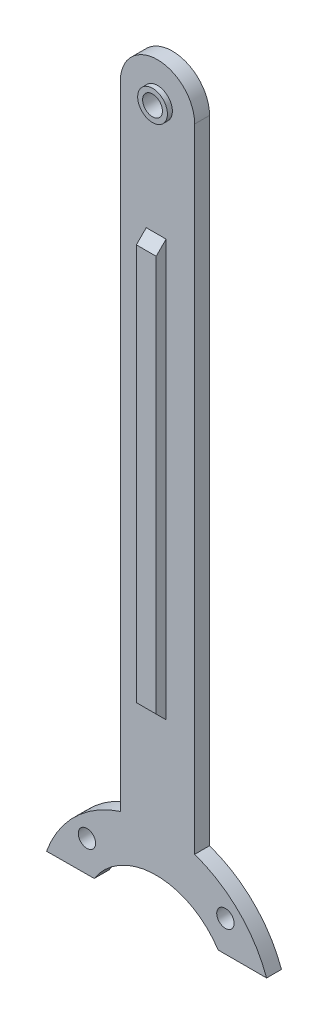
ISO-10303-21;
HEADER;
FILE_DESCRIPTION(('STEP AP214'),'2;1');
FILE_NAME('part.step','',(''),(''),'','','');
FILE_SCHEMA(('AUTOMOTIVE_DESIGN { 1 0 10303 214 1 1 1 1 }'));
ENDSEC;
DATA;
#1=APPLICATION_CONTEXT('core data for automotive mechanical design processes');
#2=APPLICATION_PROTOCOL_DEFINITION('international standard','automotive_design',2000,#1);
#3=PRODUCT_CONTEXT('',#1,'mechanical');
#4=PRODUCT('Part','Part','',(#3));
#5=PRODUCT_RELATED_PRODUCT_CATEGORY('part','',(#4));
#6=PRODUCT_DEFINITION_FORMATION('','',#4);
#7=PRODUCT_DEFINITION_CONTEXT('part definition',#1,'design');
#8=PRODUCT_DEFINITION('design','',#6,#7);
#9=PRODUCT_DEFINITION_SHAPE('','',#8);
#10=(LENGTH_UNIT() NAMED_UNIT(*) SI_UNIT(.MILLI.,.METRE.));
#11=(NAMED_UNIT(*) PLANE_ANGLE_UNIT() SI_UNIT($,.RADIAN.));
#12=(NAMED_UNIT(*) SI_UNIT($,.STERADIAN.) SOLID_ANGLE_UNIT());
#13=UNCERTAINTY_MEASURE_WITH_UNIT(LENGTH_MEASURE(1.E-05),#10,'distance_accuracy_value','');
#14=(GEOMETRIC_REPRESENTATION_CONTEXT(3) GLOBAL_UNCERTAINTY_ASSIGNED_CONTEXT((#13)) GLOBAL_UNIT_ASSIGNED_CONTEXT((#10,
#11,#12)) REPRESENTATION_CONTEXT('',''));
#15=CARTESIAN_POINT('',(0.,0.,0.));
#16=DIRECTION('',(0.,0.,1.));
#17=DIRECTION('',(1.,0.,0.));
#18=AXIS2_PLACEMENT_3D('',#15,#16,#17);
#19=CARTESIAN_POINT('',(-29.0000000968576,29.0000015694326,3.));
#20=DIRECTION('',(0.,0.,-1.));
#21=DIRECTION('',(-1.,0.,0.));
#22=AXIS2_PLACEMENT_3D('',#19,#20,#21);
#23=PLANE('',#22);
#24=CARTESIAN_POINT('',(-28.7319590709669,178.999762082603,3.));
#25=DIRECTION('',(0.,0.,-1.));
#26=DIRECTION('',(-1.,0.,0.));
#27=AXIS2_PLACEMENT_3D('',#24,#25,#26);
#28=CIRCLE('',#27,2.99999999999999);
#29=CARTESIAN_POINT('',(-31.7319590709669,178.999762082603,3.));
#30=VERTEX_POINT('',#29);
#31=EDGE_CURVE('E143',#30,#30,#28,.F.);
#32=ORIENTED_EDGE('',*,*,#31,.F.);
#33=EDGE_LOOP('',(#32));
#34=FACE_BOUND('',#33,.T.);
#35=CARTESIAN_POINT('',(-29.0000000968576,29.0000015694326,3.));
#36=DIRECTION('',(0.,0.,-1.));
#37=DIRECTION('',(-1.,0.,0.));
#38=AXIS2_PLACEMENT_3D('',#35,#36,#37);
#39=CIRCLE('',#38,14.8499991396063);
#40=CARTESIAN_POINT('',(-41.4972007274628,37.0213761925697,3.));
#41=VERTEX_POINT('',#40);
#42=CARTESIAN_POINT('',(-16.5027994662523,37.0213761925697,3.));
#43=VERTEX_POINT('',#42);
#44=EDGE_CURVE('E129',#41,#43,#39,.T.);
#45=ORIENTED_EDGE('',*,*,#44,.T.);
#46=DIRECTION('',(1.,0.,0.));
#47=VECTOR('',#46,1.);
#48=CARTESIAN_POINT('',(-16.5027994662523,37.0213761925697,3.));
#49=LINE('',#48,#47);
#50=CARTESIAN_POINT('',(-6.71536289155483,37.0213761925697,3.));
#51=VERTEX_POINT('',#50);
#52=EDGE_CURVE('E118',#43,#51,#49,.T.);
#53=ORIENTED_EDGE('',*,*,#52,.T.);
#54=CARTESIAN_POINT('',(-29.0000000968576,29.0000015694326,3.));
#55=DIRECTION('',(0.,0.,1.));
#56=DIRECTION('',(1.,0.,0.));
#57=AXIS2_PLACEMENT_3D('',#54,#55,#56);
#58=CIRCLE('',#57,23.6843303940954);
#59=CARTESIAN_POINT('',(-21.2319590709669,51.3742064678586,3.));
#60=VERTEX_POINT('',#59);
#61=EDGE_CURVE('E128',#51,#60,#58,.T.);
#62=ORIENTED_EDGE('',*,*,#61,.T.);
#63=DIRECTION('',(0.,1.,0.));
#64=VECTOR('',#63,1.);
#65=CARTESIAN_POINT('',(-21.2319590709669,178.999762082603,3.));
#66=LINE('',#65,#64);
#67=CARTESIAN_POINT('',(-21.2319590709669,178.999762082603,3.));
#68=VERTEX_POINT('',#67);
#69=EDGE_CURVE('E214',#60,#68,#66,.T.);
#70=ORIENTED_EDGE('',*,*,#69,.T.);
#71=CARTESIAN_POINT('',(-28.7319590709669,178.999762082603,3.));
#72=DIRECTION('',(0.,0.,1.));
#73=DIRECTION('',(1.,0.,0.));
#74=AXIS2_PLACEMENT_3D('',#71,#72,#73);
#75=CIRCLE('',#74,7.50000000000001);
#76=CARTESIAN_POINT('',(-36.2319590709669,178.999762082603,3.));
#77=VERTEX_POINT('',#76);
#78=EDGE_CURVE('E216',#68,#77,#75,.T.);
#79=ORIENTED_EDGE('',*,*,#78,.T.);
#80=DIRECTION('',(0.,-1.,0.));
#81=VECTOR('',#80,1.);
#82=CARTESIAN_POINT('',(-36.2319590709669,51.3739538020425,3.));
#83=LINE('',#82,#81);
#84=CARTESIAN_POINT('',(-36.2319590709669,51.3739538020425,3.));
#85=VERTEX_POINT('',#84);
#86=EDGE_CURVE('E218',#77,#85,#83,.T.);
#87=ORIENTED_EDGE('',*,*,#86,.T.);
#88=CARTESIAN_POINT('',(-29.0000000968576,29.0000015694326,3.));
#89=DIRECTION('',(0.,0.,1.));
#90=DIRECTION('',(1.,0.,0.));
#91=AXIS2_PLACEMENT_3D('',#88,#89,#90);
#92=CIRCLE('',#91,23.5137187426896);
#93=CARTESIAN_POINT('',(-51.1241088556617,36.9635925144095,3.));
#94=VERTEX_POINT('',#93);
#95=EDGE_CURVE('E220',#85,#94,#92,.T.);
#96=ORIENTED_EDGE('',*,*,#95,.T.);
#97=DIRECTION('',(0.999981986629532,0.00600220096753658,0.));
#98=VECTOR('',#97,1.);
#99=CARTESIAN_POINT('',(-51.1241088556617,36.9635925144095,3.));
#100=LINE('',#99,#98);
#101=EDGE_CURVE('E134',#94,#41,#100,.T.);
#102=ORIENTED_EDGE('',*,*,#101,.T.);
#103=EDGE_LOOP('',(#45,#53,#62,#70,#79,#87,#96,#102));
#104=FACE_BOUND('',#103,.T.);
#105=CARTESIAN_POINT('',(-42.9680608212948,43.2889966521514,3.));
#106=DIRECTION('',(0.,0.,1.));
#107=DIRECTION('',(1.,0.,0.));
#108=AXIS2_PLACEMENT_3D('',#105,#106,#107);
#109=CIRCLE('',#108,1.75000070478217);
#110=CARTESIAN_POINT('',(-41.2180601165126,43.2889966521514,3.));
#111=VERTEX_POINT('',#110);
#112=EDGE_CURVE('E208',#111,#111,#109,.T.);
#113=ORIENTED_EDGE('',*,*,#112,.F.);
#114=EDGE_LOOP('',(#113));
#115=FACE_BOUND('',#114,.T.);
#116=CARTESIAN_POINT('',(-15.030000194473,43.2889966521514,3.));
#117=DIRECTION('',(0.,0.,1.));
#118=DIRECTION('',(1.,0.,0.));
#119=AXIS2_PLACEMENT_3D('',#116,#117,#118);
#120=CIRCLE('',#119,1.75000070478217);
#121=CARTESIAN_POINT('',(-13.2799994896908,43.2889966521514,3.));
#122=VERTEX_POINT('',#121);
#123=EDGE_CURVE('E202',#122,#122,#120,.T.);
#124=ORIENTED_EDGE('',*,*,#123,.F.);
#125=EDGE_LOOP('',(#124));
#126=FACE_BOUND('',#125,.T.);
#127=DIRECTION('',(0.,1.,0.));
#128=VECTOR('',#127,1.);
#129=CARTESIAN_POINT('',(-27.0000000968576,64.0021571401982,3.));
#130=LINE('',#129,#128);
#131=CARTESIAN_POINT('',(-27.0000000968576,72.0021571401983,3.));
#132=VERTEX_POINT('',#131);
#133=CARTESIAN_POINT('',(-27.0000000968576,156.002157140198,3.));
#134=VERTEX_POINT('',#133);
#135=EDGE_CURVE('E168',#132,#134,#130,.T.);
#136=ORIENTED_EDGE('',*,*,#135,.F.);
#137=DIRECTION('',(-1.,0.,0.));
#138=VECTOR('',#137,1.);
#139=CARTESIAN_POINT('',(-29.0000000968576,72.0021571401983,3.));
#140=LINE('',#139,#138);
#141=CARTESIAN_POINT('',(-31.0000000968576,72.0021571401983,3.));
#142=VERTEX_POINT('',#141);
#143=EDGE_CURVE('E11',#132,#142,#140,.T.);
#144=ORIENTED_EDGE('',*,*,#143,.T.);
#145=DIRECTION('',(0.,1.,0.));
#146=VECTOR('',#145,1.);
#147=CARTESIAN_POINT('',(-31.0000000968576,64.0021571401982,3.));
#148=LINE('',#147,#146);
#149=CARTESIAN_POINT('',(-31.0000000968575,156.002157140198,3.));
#150=VERTEX_POINT('',#149);
#151=EDGE_CURVE('E170',#142,#150,#148,.T.);
#152=ORIENTED_EDGE('',*,*,#151,.T.);
#153=DIRECTION('',(1.,0.,0.));
#154=VECTOR('',#153,1.);
#155=CARTESIAN_POINT('',(-29.0000000968576,156.002157140198,3.));
#156=LINE('',#155,#154);
#157=EDGE_CURVE('E43',#150,#134,#156,.T.);
#158=ORIENTED_EDGE('',*,*,#157,.T.);
#159=EDGE_LOOP('',(#136,#144,#152,#158));
#160=FACE_BOUND('',#159,.T.);
#161=ADVANCED_FACE('F34',(#34,#104,#115,#126,#160),#23,.F.);
#162=CARTESIAN_POINT('',(-29.0000000968576,29.0000015694326,0.));
#163=DIRECTION('',(0.,0.,-1.));
#164=DIRECTION('',(-1.,0.,0.));
#165=AXIS2_PLACEMENT_3D('',#162,#163,#164);
#166=PLANE('',#165);
#167=CARTESIAN_POINT('',(-15.030000194473,43.2889966521514,0.));
#168=DIRECTION('',(0.,0.,1.));
#169=DIRECTION('',(1.,0.,0.));
#170=AXIS2_PLACEMENT_3D('',#167,#168,#169);
#171=CIRCLE('',#170,1.75000070478217);
#172=CARTESIAN_POINT('',(-13.2799994896908,43.2889966521514,0.));
#173=VERTEX_POINT('',#172);
#174=EDGE_CURVE('E201',#173,#173,#171,.T.);
#175=ORIENTED_EDGE('',*,*,#174,.T.);
#176=EDGE_LOOP('',(#175));
#177=FACE_BOUND('',#176,.T.);
#178=CARTESIAN_POINT('',(-29.0000000968576,29.0000015694326,0.));
#179=DIRECTION('',(0.,0.,-1.));
#180=DIRECTION('',(-1.,0.,0.));
#181=AXIS2_PLACEMENT_3D('',#178,#179,#180);
#182=CIRCLE('',#181,14.8499991396063);
#183=CARTESIAN_POINT('',(-41.4972007274628,37.0213761925697,0.));
#184=VERTEX_POINT('',#183);
#185=CARTESIAN_POINT('',(-16.5027994662523,37.0213761925697,0.));
#186=VERTEX_POINT('',#185);
#187=EDGE_CURVE('E142',#184,#186,#182,.T.);
#188=ORIENTED_EDGE('',*,*,#187,.F.);
#189=DIRECTION('',(0.999981986629532,0.00600220096753658,0.));
#190=VECTOR('',#189,1.);
#191=CARTESIAN_POINT('',(-51.1241088556617,36.9635925144095,0.));
#192=LINE('',#191,#190);
#193=CARTESIAN_POINT('',(-51.1241088556617,36.9635925144095,0.));
#194=VERTEX_POINT('',#193);
#195=EDGE_CURVE('E138',#194,#184,#192,.T.);
#196=ORIENTED_EDGE('',*,*,#195,.F.);
#197=CARTESIAN_POINT('',(-29.0000000968576,29.0000015694326,0.));
#198=DIRECTION('',(0.,0.,1.));
#199=DIRECTION('',(1.,0.,0.));
#200=AXIS2_PLACEMENT_3D('',#197,#198,#199);
#201=CIRCLE('',#200,23.5137187426896);
#202=CARTESIAN_POINT('',(-36.2319590709669,51.3739538020425,0.));
#203=VERTEX_POINT('',#202);
#204=EDGE_CURVE('E235',#203,#194,#201,.T.);
#205=ORIENTED_EDGE('',*,*,#204,.F.);
#206=DIRECTION('',(0.,-1.,0.));
#207=VECTOR('',#206,1.);
#208=CARTESIAN_POINT('',(-36.2319590709669,51.3739538020425,0.));
#209=LINE('',#208,#207);
#210=CARTESIAN_POINT('',(-36.2319590709669,178.999762082603,0.));
#211=VERTEX_POINT('',#210);
#212=EDGE_CURVE('E233',#211,#203,#209,.T.);
#213=ORIENTED_EDGE('',*,*,#212,.F.);
#214=CARTESIAN_POINT('',(-28.7319590709669,178.999762082603,0.));
#215=DIRECTION('',(0.,0.,1.));
#216=DIRECTION('',(1.,0.,0.));
#217=AXIS2_PLACEMENT_3D('',#214,#215,#216);
#218=CIRCLE('',#217,7.50000000000001);
#219=CARTESIAN_POINT('',(-21.2319590709669,178.999762082603,0.));
#220=VERTEX_POINT('',#219);
#221=EDGE_CURVE('E231',#220,#211,#218,.T.);
#222=ORIENTED_EDGE('',*,*,#221,.F.);
#223=DIRECTION('',(0.,1.,0.));
#224=VECTOR('',#223,1.);
#225=CARTESIAN_POINT('',(-21.2319590709669,178.999762082603,0.));
#226=LINE('',#225,#224);
#227=CARTESIAN_POINT('',(-21.2319590709669,51.3742064678586,0.));
#228=VERTEX_POINT('',#227);
#229=EDGE_CURVE('E229',#228,#220,#226,.T.);
#230=ORIENTED_EDGE('',*,*,#229,.F.);
#231=CARTESIAN_POINT('',(-29.0000000968576,29.0000015694326,0.));
#232=DIRECTION('',(0.,0.,1.));
#233=DIRECTION('',(1.,0.,0.));
#234=AXIS2_PLACEMENT_3D('',#231,#232,#233);
#235=CIRCLE('',#234,23.6843303940954);
#236=CARTESIAN_POINT('',(-6.71536289155483,37.0213761925697,0.));
#237=VERTEX_POINT('',#236);
#238=EDGE_CURVE('E227',#237,#228,#235,.T.);
#239=ORIENTED_EDGE('',*,*,#238,.F.);
#240=DIRECTION('',(1.,0.,0.));
#241=VECTOR('',#240,1.);
#242=CARTESIAN_POINT('',(-16.5027994662523,37.0213761925697,0.));
#243=LINE('',#242,#241);
#244=EDGE_CURVE('E225',#186,#237,#243,.T.);
#245=ORIENTED_EDGE('',*,*,#244,.F.);
#246=EDGE_LOOP('',(#188,#196,#205,#213,#222,#230,#239,#245));
#247=FACE_BOUND('',#246,.T.);
#248=CARTESIAN_POINT('',(-42.9680608212948,43.2889966521514,0.));
#249=DIRECTION('',(0.,0.,1.));
#250=DIRECTION('',(1.,0.,0.));
#251=AXIS2_PLACEMENT_3D('',#248,#249,#250);
#252=CIRCLE('',#251,1.75000070478217);
#253=CARTESIAN_POINT('',(-41.2180601165126,43.2889966521514,0.));
#254=VERTEX_POINT('',#253);
#255=EDGE_CURVE('E205',#254,#254,#252,.T.);
#256=ORIENTED_EDGE('',*,*,#255,.T.);
#257=EDGE_LOOP('',(#256));
#258=FACE_BOUND('',#257,.T.);
#259=CARTESIAN_POINT('',(-28.7319590709669,178.999762082603,0.));
#260=DIRECTION('',(0.,0.,1.));
#261=DIRECTION('',(1.,0.,0.));
#262=AXIS2_PLACEMENT_3D('',#259,#260,#261);
#263=CIRCLE('',#262,2.00000000365453);
#264=CARTESIAN_POINT('',(-26.7319590673123,178.999762082603,0.));
#265=VERTEX_POINT('',#264);
#266=EDGE_CURVE('E198',#265,#265,#263,.T.);
#267=ORIENTED_EDGE('',*,*,#266,.T.);
#268=EDGE_LOOP('',(#267));
#269=FACE_BOUND('',#268,.T.);
#270=ADVANCED_FACE('F261',(#177,#247,#258,#269),#166,.T.);
#271=CARTESIAN_POINT('',(-29.0000000968576,29.0000015694326,3.));
#272=DIRECTION('',(0.,0.,-1.));
#273=DIRECTION('',(-1.,0.,0.));
#274=AXIS2_PLACEMENT_3D('',#271,#272,#273);
#275=CYLINDRICAL_SURFACE('',#274,14.8499991396063);
#276=ORIENTED_EDGE('',*,*,#187,.T.);
#277=DIRECTION('',(0.,0.,-1.));
#278=VECTOR('',#277,1.);
#279=CARTESIAN_POINT('',(-16.5027994662523,37.0213761925697,3.));
#280=LINE('',#279,#278);
#281=EDGE_CURVE('E122',#43,#186,#280,.T.);
#282=ORIENTED_EDGE('',*,*,#281,.F.);
#283=ORIENTED_EDGE('',*,*,#44,.F.);
#284=DIRECTION('',(0.,0.,-1.));
#285=VECTOR('',#284,1.);
#286=CARTESIAN_POINT('',(-41.4972007274628,37.0213761925697,3.));
#287=LINE('',#286,#285);
#288=EDGE_CURVE('E223',#41,#184,#287,.T.);
#289=ORIENTED_EDGE('',*,*,#288,.T.);
#290=EDGE_LOOP('',(#276,#282,#283,#289));
#291=FACE_BOUND('',#290,.T.);
#292=ADVANCED_FACE('F140',(#291),#275,.F.);
#293=CARTESIAN_POINT('',(-16.5027994662523,37.0213761925697,3.));
#294=DIRECTION('',(0.,1.,0.));
#295=DIRECTION('',(0.,0.,1.));
#296=AXIS2_PLACEMENT_3D('',#293,#294,#295);
#297=PLANE('',#296);
#298=ORIENTED_EDGE('',*,*,#244,.T.);
#299=DIRECTION('',(0.,0.,-1.));
#300=VECTOR('',#299,1.);
#301=CARTESIAN_POINT('',(-6.71536289155483,37.0213761925697,3.));
#302=LINE('',#301,#300);
#303=EDGE_CURVE('E125',#51,#237,#302,.T.);
#304=ORIENTED_EDGE('',*,*,#303,.F.);
#305=ORIENTED_EDGE('',*,*,#52,.F.);
#306=ORIENTED_EDGE('',*,*,#281,.T.);
#307=EDGE_LOOP('',(#298,#304,#305,#306));
#308=FACE_BOUND('',#307,.T.);
#309=ADVANCED_FACE('F120',(#308),#297,.F.);
#310=CARTESIAN_POINT('',(-29.0000000968576,29.0000015694326,3.));
#311=DIRECTION('',(0.,0.,-1.));
#312=DIRECTION('',(-1.,0.,0.));
#313=AXIS2_PLACEMENT_3D('',#310,#311,#312);
#314=CYLINDRICAL_SURFACE('',#313,23.6843303940954);
#315=ORIENTED_EDGE('',*,*,#238,.T.);
#316=DIRECTION('',(0.,0.,-1.));
#317=VECTOR('',#316,1.);
#318=CARTESIAN_POINT('',(-21.2319590709669,51.3742064678586,3.));
#319=LINE('',#318,#317);
#320=EDGE_CURVE('E148',#60,#228,#319,.T.);
#321=ORIENTED_EDGE('',*,*,#320,.F.);
#322=ORIENTED_EDGE('',*,*,#61,.F.);
#323=ORIENTED_EDGE('',*,*,#303,.T.);
#324=EDGE_LOOP('',(#315,#321,#322,#323));
#325=FACE_BOUND('',#324,.T.);
#326=ADVANCED_FACE('F275',(#325),#314,.T.);
#327=CARTESIAN_POINT('',(-21.2319590709669,178.999762082603,3.));
#328=DIRECTION('',(-1.,0.,0.));
#329=DIRECTION('',(0.,-1.,0.));
#330=AXIS2_PLACEMENT_3D('',#327,#328,#329);
#331=PLANE('',#330);
#332=ORIENTED_EDGE('',*,*,#229,.T.);
#333=DIRECTION('',(0.,0.,-1.));
#334=VECTOR('',#333,1.);
#335=CARTESIAN_POINT('',(-21.2319590709669,178.999762082603,3.));
#336=LINE('',#335,#334);
#337=EDGE_CURVE('E248',#68,#220,#336,.T.);
#338=ORIENTED_EDGE('',*,*,#337,.F.);
#339=ORIENTED_EDGE('',*,*,#69,.F.);
#340=ORIENTED_EDGE('',*,*,#320,.T.);
#341=EDGE_LOOP('',(#332,#338,#339,#340));
#342=FACE_BOUND('',#341,.T.);
#343=ADVANCED_FACE('F255',(#342),#331,.F.);
#344=CARTESIAN_POINT('',(-28.7319590709669,178.999762082603,3.));
#345=DIRECTION('',(0.,0.,-1.));
#346=DIRECTION('',(-1.,0.,0.));
#347=AXIS2_PLACEMENT_3D('',#344,#345,#346);
#348=CYLINDRICAL_SURFACE('',#347,7.50000000000001);
#349=ORIENTED_EDGE('',*,*,#221,.T.);
#350=DIRECTION('',(0.,0.,-1.));
#351=VECTOR('',#350,1.);
#352=CARTESIAN_POINT('',(-36.2319590709669,178.999762082603,3.));
#353=LINE('',#352,#351);
#354=EDGE_CURVE('E245',#77,#211,#353,.T.);
#355=ORIENTED_EDGE('',*,*,#354,.F.);
#356=ORIENTED_EDGE('',*,*,#78,.F.);
#357=ORIENTED_EDGE('',*,*,#337,.T.);
#358=EDGE_LOOP('',(#349,#355,#356,#357));
#359=FACE_BOUND('',#358,.T.);
#360=ADVANCED_FACE('F267',(#359),#348,.T.);
#361=CARTESIAN_POINT('',(-36.2319590709669,51.3739538020425,3.));
#362=DIRECTION('',(1.,0.,0.));
#363=DIRECTION('',(0.,1.,0.));
#364=AXIS2_PLACEMENT_3D('',#361,#362,#363);
#365=PLANE('',#364);
#366=ORIENTED_EDGE('',*,*,#212,.T.);
#367=DIRECTION('',(0.,0.,-1.));
#368=VECTOR('',#367,1.);
#369=CARTESIAN_POINT('',(-36.2319590709669,51.3739538020425,3.));
#370=LINE('',#369,#368);
#371=EDGE_CURVE('E242',#85,#203,#370,.T.);
#372=ORIENTED_EDGE('',*,*,#371,.F.);
#373=ORIENTED_EDGE('',*,*,#86,.F.);
#374=ORIENTED_EDGE('',*,*,#354,.T.);
#375=EDGE_LOOP('',(#366,#372,#373,#374));
#376=FACE_BOUND('',#375,.T.);
#377=ADVANCED_FACE('F271',(#376),#365,.F.);
#378=CARTESIAN_POINT('',(-29.0000000968576,29.0000015694326,3.));
#379=DIRECTION('',(0.,0.,-1.));
#380=DIRECTION('',(-1.,0.,0.));
#381=AXIS2_PLACEMENT_3D('',#378,#379,#380);
#382=CYLINDRICAL_SURFACE('',#381,23.5137187426896);
#383=ORIENTED_EDGE('',*,*,#204,.T.);
#384=DIRECTION('',(0.,0.,-1.));
#385=VECTOR('',#384,1.);
#386=CARTESIAN_POINT('',(-51.1241088556617,36.9635925144095,3.));
#387=LINE('',#386,#385);
#388=EDGE_CURVE('E239',#94,#194,#387,.T.);
#389=ORIENTED_EDGE('',*,*,#388,.F.);
#390=ORIENTED_EDGE('',*,*,#95,.F.);
#391=ORIENTED_EDGE('',*,*,#371,.T.);
#392=EDGE_LOOP('',(#383,#389,#390,#391));
#393=FACE_BOUND('',#392,.T.);
#394=ADVANCED_FACE('F300',(#393),#382,.T.);
#395=CARTESIAN_POINT('',(-51.1241088556617,36.9635925144095,3.));
#396=DIRECTION('',(-0.00600220096753658,0.999981986629532,0.));
#397=DIRECTION('',(-0.999981986629532,-0.00600220096753658,0.));
#398=AXIS2_PLACEMENT_3D('',#395,#396,#397);
#399=PLANE('',#398);
#400=ORIENTED_EDGE('',*,*,#195,.T.);
#401=ORIENTED_EDGE('',*,*,#288,.F.);
#402=ORIENTED_EDGE('',*,*,#101,.F.);
#403=ORIENTED_EDGE('',*,*,#388,.T.);
#404=EDGE_LOOP('',(#400,#401,#402,#403));
#405=FACE_BOUND('',#404,.T.);
#406=ADVANCED_FACE('F297',(#405),#399,.F.);
#407=CARTESIAN_POINT('',(-42.9680608212948,43.2889966521514,3.));
#408=DIRECTION('',(0.,0.,-1.));
#409=DIRECTION('',(-1.,0.,0.));
#410=AXIS2_PLACEMENT_3D('',#407,#408,#409);
#411=CYLINDRICAL_SURFACE('',#410,1.75000070478217);
#412=ORIENTED_EDGE('',*,*,#112,.T.);
#413=EDGE_LOOP('',(#412));
#414=FACE_BOUND('',#413,.T.);
#415=ORIENTED_EDGE('',*,*,#255,.F.);
#416=EDGE_LOOP('',(#415));
#417=FACE_BOUND('',#416,.T.);
#418=ADVANCED_FACE('F294',(#414,#417),#411,.F.);
#419=CARTESIAN_POINT('',(-15.030000194473,43.2889966521514,3.));
#420=DIRECTION('',(0.,0.,-1.));
#421=DIRECTION('',(-1.,0.,0.));
#422=AXIS2_PLACEMENT_3D('',#419,#420,#421);
#423=CYLINDRICAL_SURFACE('',#422,1.75000070478217);
#424=ORIENTED_EDGE('',*,*,#123,.T.);
#425=EDGE_LOOP('',(#424));
#426=FACE_BOUND('',#425,.T.);
#427=ORIENTED_EDGE('',*,*,#174,.F.);
#428=EDGE_LOOP('',(#427));
#429=FACE_BOUND('',#428,.T.);
#430=ADVANCED_FACE('F330',(#426,#429),#423,.F.);
#431=CARTESIAN_POINT('',(-28.7319590709669,178.999762082603,3.));
#432=DIRECTION('',(0.,0.,-1.));
#433=DIRECTION('',(-1.,0.,0.));
#434=AXIS2_PLACEMENT_3D('',#431,#432,#433);
#435=CYLINDRICAL_SURFACE('',#434,2.00000000365453);
#436=ORIENTED_EDGE('',*,*,#266,.F.);
#437=EDGE_LOOP('',(#436));
#438=FACE_BOUND('',#437,.T.);
#439=CARTESIAN_POINT('',(-28.7319590709669,178.999762082603,4.));
#440=DIRECTION('',(0.,0.,1.));
#441=DIRECTION('',(1.,0.,0.));
#442=AXIS2_PLACEMENT_3D('',#439,#440,#441);
#443=CIRCLE('',#442,2.);
#444=CARTESIAN_POINT('',(-26.7319590709669,178.999762082603,4.));
#445=VERTEX_POINT('',#444);
#446=EDGE_CURVE('E188',#445,#445,#443,.T.);
#447=ORIENTED_EDGE('',*,*,#446,.T.);
#448=EDGE_LOOP('',(#447));
#449=FACE_BOUND('',#448,.T.);
#450=ADVANCED_FACE('F337',(#438,#449),#435,.F.);
#451=CARTESIAN_POINT('',(-28.7319590709669,178.999762082603,4.));
#452=DIRECTION('',(0.,0.,1.));
#453=DIRECTION('',(1.,0.,0.));
#454=AXIS2_PLACEMENT_3D('',#451,#452,#453);
#455=PLANE('',#454);
#456=CARTESIAN_POINT('',(-28.7319590709669,178.999762082603,4.));
#457=DIRECTION('',(0.,0.,1.));
#458=DIRECTION('',(1.,0.,0.));
#459=AXIS2_PLACEMENT_3D('',#456,#457,#458);
#460=CIRCLE('',#459,2.99999999999999);
#461=CARTESIAN_POINT('',(-25.7319590709669,178.999762082603,4.));
#462=VERTEX_POINT('',#461);
#463=EDGE_CURVE('E191',#462,#462,#460,.T.);
#464=ORIENTED_EDGE('',*,*,#463,.T.);
#465=EDGE_LOOP('',(#464));
#466=FACE_BOUND('',#465,.T.);
#467=ORIENTED_EDGE('',*,*,#446,.F.);
#468=EDGE_LOOP('',(#467));
#469=FACE_BOUND('',#468,.T.);
#470=ADVANCED_FACE('F344',(#466,#469),#455,.T.);
#471=CARTESIAN_POINT('',(-28.7319590709669,178.999762082603,4.));
#472=DIRECTION('',(0.,0.,-1.));
#473=DIRECTION('',(-1.,0.,0.));
#474=AXIS2_PLACEMENT_3D('',#471,#472,#473);
#475=CYLINDRICAL_SURFACE('',#474,2.99999999999999);
#476=ORIENTED_EDGE('',*,*,#463,.F.);
#477=EDGE_LOOP('',(#476));
#478=FACE_BOUND('',#477,.T.);
#479=ORIENTED_EDGE('',*,*,#31,.T.);
#480=EDGE_LOOP('',(#479));
#481=FACE_BOUND('',#480,.T.);
#482=ADVANCED_FACE('F352',(#478,#481),#475,.T.);
#483=CARTESIAN_POINT('',(-27.0000000968576,64.0021571401982,5.));
#484=DIRECTION('',(-1.,0.,0.));
#485=DIRECTION('',(0.,-1.,0.));
#486=AXIS2_PLACEMENT_3D('',#483,#484,#485);
#487=PLANE('',#486);
#488=ORIENTED_EDGE('',*,*,#135,.T.);
#489=DIRECTION('',(0.,-0.707106781186544,0.707106781186551));
#490=VECTOR('',#489,1.);
#491=CARTESIAN_POINT('',(-27.0000000968576,164.002157140198,-5.00000000000017));
#492=LINE('',#491,#490);
#493=CARTESIAN_POINT('',(-27.0000000968576,154.002157140198,5.));
#494=VERTEX_POINT('',#493);
#495=EDGE_CURVE('E154',#134,#494,#492,.T.);
#496=ORIENTED_EDGE('',*,*,#495,.T.);
#497=DIRECTION('',(0.,1.,0.));
#498=VECTOR('',#497,1.);
#499=CARTESIAN_POINT('',(-27.0000000968576,64.0021571401982,5.));
#500=LINE('',#499,#498);
#501=CARTESIAN_POINT('',(-27.0000000968576,74.0021571401982,5.));
#502=VERTEX_POINT('',#501);
#503=EDGE_CURVE('E185',#502,#494,#500,.T.);
#504=ORIENTED_EDGE('',*,*,#503,.F.);
#505=DIRECTION('',(0.,-0.707106781186544,-0.707106781186551));
#506=VECTOR('',#505,1.);
#507=CARTESIAN_POINT('',(-27.0000000968576,64.0021571401982,-5.00000000000017));
#508=LINE('',#507,#506);
#509=EDGE_CURVE('E146',#502,#132,#508,.T.);
#510=ORIENTED_EDGE('',*,*,#509,.T.);
#511=EDGE_LOOP('',(#488,#496,#504,#510));
#512=FACE_BOUND('',#511,.T.);
#513=ADVANCED_FACE('F174',(#512),#487,.F.);
#514=CARTESIAN_POINT('',(-31.0000000968576,64.0021571401982,5.));
#515=DIRECTION('',(-1.,0.,0.));
#516=DIRECTION('',(0.,-1.,0.));
#517=AXIS2_PLACEMENT_3D('',#514,#515,#516);
#518=PLANE('',#517);
#519=DIRECTION('',(0.,1.,0.));
#520=VECTOR('',#519,1.);
#521=CARTESIAN_POINT('',(-31.0000000968576,64.0021571401982,5.));
#522=LINE('',#521,#520);
#523=CARTESIAN_POINT('',(-31.0000000968576,74.0021571401982,5.));
#524=VERTEX_POINT('',#523);
#525=CARTESIAN_POINT('',(-31.0000000968575,154.002157140198,5.));
#526=VERTEX_POINT('',#525);
#527=EDGE_CURVE('E183',#524,#526,#522,.T.);
#528=ORIENTED_EDGE('',*,*,#527,.T.);
#529=DIRECTION('',(0.,0.707106781186544,-0.707106781186551));
#530=VECTOR('',#529,1.);
#531=CARTESIAN_POINT('',(-31.0000000968576,109.002157140199,50.));
#532=LINE('',#531,#530);
#533=EDGE_CURVE('E50',#526,#150,#532,.T.);
#534=ORIENTED_EDGE('',*,*,#533,.T.);
#535=ORIENTED_EDGE('',*,*,#151,.F.);
#536=DIRECTION('',(0.,0.707106781186544,0.707106781186551));
#537=VECTOR('',#536,1.);
#538=CARTESIAN_POINT('',(-31.0000000968576,69.0021571401983,0.));
#539=LINE('',#538,#537);
#540=EDGE_CURVE('E162',#142,#524,#539,.T.);
#541=ORIENTED_EDGE('',*,*,#540,.T.);
#542=EDGE_LOOP('',(#528,#534,#535,#541));
#543=FACE_BOUND('',#542,.T.);
#544=ADVANCED_FACE('F186',(#543),#518,.T.);
#545=CARTESIAN_POINT('',(0.,0.,5.));
#546=DIRECTION('',(0.,0.,-1.));
#547=DIRECTION('',(-1.,0.,0.));
#548=AXIS2_PLACEMENT_3D('',#545,#546,#547);
#549=PLANE('',#548);
#550=ORIENTED_EDGE('',*,*,#503,.T.);
#551=DIRECTION('',(-1.,0.,0.));
#552=VECTOR('',#551,1.);
#553=CARTESIAN_POINT('',(-31.0000000968575,154.002157140198,5.));
#554=LINE('',#553,#552);
#555=EDGE_CURVE('E159',#494,#526,#554,.T.);
#556=ORIENTED_EDGE('',*,*,#555,.T.);
#557=ORIENTED_EDGE('',*,*,#527,.F.);
#558=DIRECTION('',(1.,0.,0.));
#559=VECTOR('',#558,1.);
#560=CARTESIAN_POINT('',(-27.0000000968576,74.0021571401982,5.));
#561=LINE('',#560,#559);
#562=EDGE_CURVE('E156',#524,#502,#561,.T.);
#563=ORIENTED_EDGE('',*,*,#562,.T.);
#564=EDGE_LOOP('',(#550,#556,#557,#563));
#565=FACE_BOUND('',#564,.T.);
#566=ADVANCED_FACE('F182',(#565),#549,.F.);
#567=CARTESIAN_POINT('',(-31.0000000968575,164.002157140198,-5.00000000000017));
#568=DIRECTION('',(0.,0.707106781186551,0.707106781186544));
#569=DIRECTION('',(-1.,0.,0.));
#570=AXIS2_PLACEMENT_3D('',#567,#568,#569);
#571=PLANE('',#570);
#572=ORIENTED_EDGE('',*,*,#533,.F.);
#573=ORIENTED_EDGE('',*,*,#555,.F.);
#574=ORIENTED_EDGE('',*,*,#495,.F.);
#575=ORIENTED_EDGE('',*,*,#157,.F.);
#576=EDGE_LOOP('',(#572,#573,#574,#575));
#577=FACE_BOUND('',#576,.T.);
#578=ADVANCED_FACE('F179',(#577),#571,.T.);
#579=CARTESIAN_POINT('',(-27.0000000968576,64.0021571401982,-5.00000000000017));
#580=DIRECTION('',(0.,-0.707106781186551,0.707106781186544));
#581=DIRECTION('',(1.,0.,0.));
#582=AXIS2_PLACEMENT_3D('',#579,#580,#581);
#583=PLANE('',#582);
#584=ORIENTED_EDGE('',*,*,#509,.F.);
#585=ORIENTED_EDGE('',*,*,#562,.F.);
#586=ORIENTED_EDGE('',*,*,#540,.F.);
#587=ORIENTED_EDGE('',*,*,#143,.F.);
#588=EDGE_LOOP('',(#584,#585,#586,#587));
#589=FACE_BOUND('',#588,.T.);
#590=ADVANCED_FACE('F36',(#589),#583,.T.);
#591=CLOSED_SHELL('',(#161,#270,#292,#309,#326,#343,#360,#377,#394,#406,#418,#430,#450,#470,
#482,#513,#544,#566,#578,#590));
#592=MANIFOLD_SOLID_BREP('B2',#591);
#593=ADVANCED_BREP_SHAPE_REPRESENTATION('',(#18,#592),#14);
#594=SHAPE_DEFINITION_REPRESENTATION(#9,#593);
ENDSEC;
END-ISO-10303-21;
